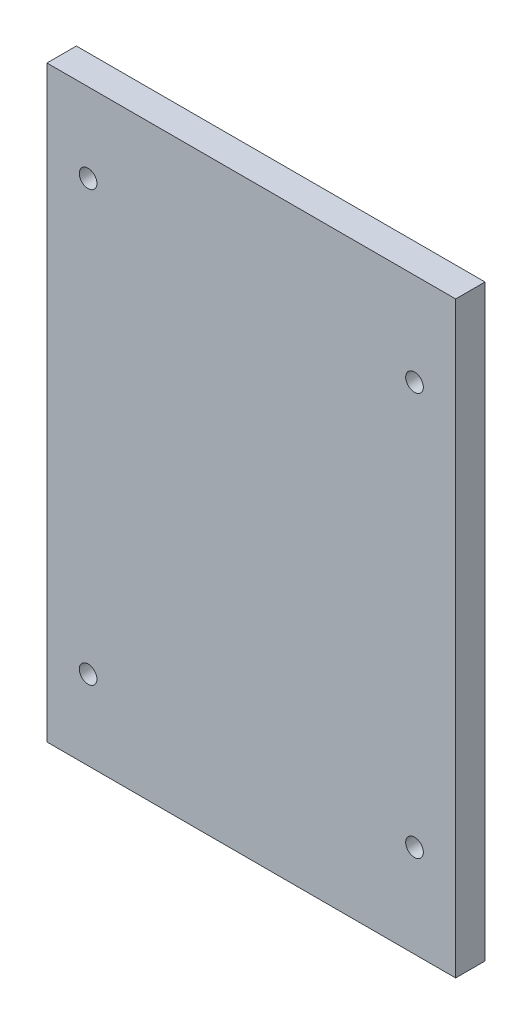
ISO-10303-21;
HEADER;
FILE_DESCRIPTION(('STEP AP214'),'2;1');
FILE_NAME('part.step','',(''),(''),'','','');
FILE_SCHEMA(('AUTOMOTIVE_DESIGN { 1 0 10303 214 1 1 1 1 }'));
ENDSEC;
DATA;
#1=APPLICATION_CONTEXT('core data for automotive mechanical design processes');
#2=APPLICATION_PROTOCOL_DEFINITION('international standard','automotive_design',2000,#1);
#3=PRODUCT_CONTEXT('',#1,'mechanical');
#4=PRODUCT('Part','Part','',(#3));
#5=PRODUCT_RELATED_PRODUCT_CATEGORY('part','',(#4));
#6=PRODUCT_DEFINITION_FORMATION('','',#4);
#7=PRODUCT_DEFINITION_CONTEXT('part definition',#1,'design');
#8=PRODUCT_DEFINITION('design','',#6,#7);
#9=PRODUCT_DEFINITION_SHAPE('','',#8);
#10=(LENGTH_UNIT() NAMED_UNIT(*) SI_UNIT(.MILLI.,.METRE.));
#11=(NAMED_UNIT(*) PLANE_ANGLE_UNIT() SI_UNIT($,.RADIAN.));
#12=(NAMED_UNIT(*) SI_UNIT($,.STERADIAN.) SOLID_ANGLE_UNIT());
#13=UNCERTAINTY_MEASURE_WITH_UNIT(LENGTH_MEASURE(1.E-05),#10,'distance_accuracy_value','');
#14=(GEOMETRIC_REPRESENTATION_CONTEXT(3) GLOBAL_UNCERTAINTY_ASSIGNED_CONTEXT((#13)) GLOBAL_UNIT_ASSIGNED_CONTEXT((#10,
#11,#12)) REPRESENTATION_CONTEXT('',''));
#15=CARTESIAN_POINT('',(0.,0.,0.));
#16=DIRECTION('',(0.,0.,1.));
#17=DIRECTION('',(1.,0.,0.));
#18=AXIS2_PLACEMENT_3D('',#15,#16,#17);
#19=CARTESIAN_POINT('',(-67.,-5.,76.0000000000007));
#20=DIRECTION('',(0.,-1.,0.));
#21=DIRECTION('',(1.,0.,0.));
#22=AXIS2_PLACEMENT_3D('',#19,#20,#21);
#23=PLANE('',#22);
#24=DIRECTION('',(1.,0.,0.));
#25=VECTOR('',#24,1.);
#26=CARTESIAN_POINT('',(-67.,-5.,81.0000000000007));
#27=LINE('',#26,#25);
#28=CARTESIAN_POINT('',(-67.,-5.,81.0000000000007));
#29=VERTEX_POINT('',#28);
#30=CARTESIAN_POINT('',(2.50000000000003,-4.99999999999999,81.0000000000007));
#31=VERTEX_POINT('',#30);
#32=EDGE_CURVE('E100',#29,#31,#27,.T.);
#33=ORIENTED_EDGE('',*,*,#32,.F.);
#34=DIRECTION('',(0.,0.,1.));
#35=VECTOR('',#34,1.);
#36=CARTESIAN_POINT('',(-67.,-5.,76.0000000000007));
#37=LINE('',#36,#35);
#38=CARTESIAN_POINT('',(-67.,-5.,76.0000000000007));
#39=VERTEX_POINT('',#38);
#40=EDGE_CURVE('E11',#39,#29,#37,.T.);
#41=ORIENTED_EDGE('',*,*,#40,.F.);
#42=DIRECTION('',(1.,0.,0.));
#43=VECTOR('',#42,1.);
#44=CARTESIAN_POINT('',(-67.,-5.,76.0000000000007));
#45=LINE('',#44,#43);
#46=CARTESIAN_POINT('',(2.50000000000003,-4.99999999999999,76.0000000000007));
#47=VERTEX_POINT('',#46);
#48=EDGE_CURVE('E93',#39,#47,#45,.T.);
#49=ORIENTED_EDGE('',*,*,#48,.T.);
#50=DIRECTION('',(0.,0.,1.));
#51=VECTOR('',#50,1.);
#52=CARTESIAN_POINT('',(2.50000000000003,-4.99999999999999,76.0000000000007));
#53=LINE('',#52,#51);
#54=EDGE_CURVE('E38',#47,#31,#53,.T.);
#55=ORIENTED_EDGE('',*,*,#54,.T.);
#56=EDGE_LOOP('',(#33,#41,#49,#55));
#57=FACE_BOUND('',#56,.T.);
#58=ADVANCED_FACE('F35',(#57),#23,.T.);
#59=CARTESIAN_POINT('',(-67.,-5.,76.0000000000007));
#60=DIRECTION('',(-1.,0.,0.));
#61=DIRECTION('',(0.,0.,1.));
#62=AXIS2_PLACEMENT_3D('',#59,#60,#61);
#63=PLANE('',#62);
#64=DIRECTION('',(0.,-1.,0.));
#65=VECTOR('',#64,1.);
#66=CARTESIAN_POINT('',(-67.,-5.,81.0000000000007));
#67=LINE('',#66,#65);
#68=CARTESIAN_POINT('',(-67.,95.,81.0000000000007));
#69=VERTEX_POINT('',#68);
#70=EDGE_CURVE('E95',#69,#29,#67,.T.);
#71=ORIENTED_EDGE('',*,*,#70,.F.);
#72=DIRECTION('',(0.,0.,1.));
#73=VECTOR('',#72,1.);
#74=CARTESIAN_POINT('',(-67.,95.,76.0000000000007));
#75=LINE('',#74,#73);
#76=CARTESIAN_POINT('',(-67.,95.,76.0000000000007));
#77=VERTEX_POINT('',#76);
#78=EDGE_CURVE('E44',#77,#69,#75,.T.);
#79=ORIENTED_EDGE('',*,*,#78,.F.);
#80=DIRECTION('',(0.,-1.,0.));
#81=VECTOR('',#80,1.);
#82=CARTESIAN_POINT('',(-67.,-5.,76.0000000000007));
#83=LINE('',#82,#81);
#84=EDGE_CURVE('E90',#77,#39,#83,.T.);
#85=ORIENTED_EDGE('',*,*,#84,.T.);
#86=ORIENTED_EDGE('',*,*,#40,.T.);
#87=EDGE_LOOP('',(#71,#79,#85,#86));
#88=FACE_BOUND('',#87,.T.);
#89=ADVANCED_FACE('F111',(#88),#63,.T.);
#90=CARTESIAN_POINT('',(2.50000000000002,95.,76.0000000000007));
#91=DIRECTION('',(0.,1.,0.));
#92=DIRECTION('',(-1.,0.,0.));
#93=AXIS2_PLACEMENT_3D('',#90,#91,#92);
#94=PLANE('',#93);
#95=DIRECTION('',(-1.,0.,0.));
#96=VECTOR('',#95,1.);
#97=CARTESIAN_POINT('',(2.50000000000002,95.,81.0000000000007));
#98=LINE('',#97,#96);
#99=CARTESIAN_POINT('',(2.50000000000002,95.,81.0000000000007));
#100=VERTEX_POINT('',#99);
#101=EDGE_CURVE('E85',#100,#69,#98,.T.);
#102=ORIENTED_EDGE('',*,*,#101,.F.);
#103=DIRECTION('',(0.,0.,1.));
#104=VECTOR('',#103,1.);
#105=CARTESIAN_POINT('',(2.50000000000002,95.,76.0000000000007));
#106=LINE('',#105,#104);
#107=CARTESIAN_POINT('',(2.50000000000002,95.,76.0000000000007));
#108=VERTEX_POINT('',#107);
#109=EDGE_CURVE('E80',#108,#100,#106,.T.);
#110=ORIENTED_EDGE('',*,*,#109,.F.);
#111=DIRECTION('',(-1.,0.,0.));
#112=VECTOR('',#111,1.);
#113=CARTESIAN_POINT('',(2.50000000000002,95.,76.0000000000007));
#114=LINE('',#113,#112);
#115=EDGE_CURVE('E83',#108,#77,#114,.T.);
#116=ORIENTED_EDGE('',*,*,#115,.T.);
#117=ORIENTED_EDGE('',*,*,#78,.T.);
#118=EDGE_LOOP('',(#102,#110,#116,#117));
#119=FACE_BOUND('',#118,.T.);
#120=ADVANCED_FACE('F82',(#119),#94,.T.);
#121=CARTESIAN_POINT('',(2.50000000000003,-4.99999999999999,76.0000000000007));
#122=DIRECTION('',(1.,0.,0.));
#123=DIRECTION('',(0.,1.,0.));
#124=AXIS2_PLACEMENT_3D('',#121,#122,#123);
#125=PLANE('',#124);
#126=DIRECTION('',(0.,1.,0.));
#127=VECTOR('',#126,1.);
#128=CARTESIAN_POINT('',(2.50000000000003,-4.99999999999999,81.0000000000007));
#129=LINE('',#128,#127);
#130=EDGE_CURVE('E103',#31,#100,#129,.T.);
#131=ORIENTED_EDGE('',*,*,#130,.F.);
#132=ORIENTED_EDGE('',*,*,#54,.F.);
#133=DIRECTION('',(0.,1.,0.));
#134=VECTOR('',#133,1.);
#135=CARTESIAN_POINT('',(2.50000000000003,-4.99999999999999,76.0000000000007));
#136=LINE('',#135,#134);
#137=EDGE_CURVE('E89',#47,#108,#136,.T.);
#138=ORIENTED_EDGE('',*,*,#137,.T.);
#139=ORIENTED_EDGE('',*,*,#109,.T.);
#140=EDGE_LOOP('',(#131,#132,#138,#139));
#141=FACE_BOUND('',#140,.T.);
#142=ADVANCED_FACE('F92',(#141),#125,.T.);
#143=CARTESIAN_POINT('',(0.,0.,76.0000000000007));
#144=DIRECTION('',(0.,0.,1.));
#145=DIRECTION('',(1.,0.,0.));
#146=AXIS2_PLACEMENT_3D('',#143,#144,#145);
#147=PLANE('',#146);
#148=CARTESIAN_POINT('',(-4.49999999999956,10.75,76.0000000000007));
#149=DIRECTION('',(0.,0.,1.));
#150=DIRECTION('',(1.,0.,0.));
#151=AXIS2_PLACEMENT_3D('',#148,#149,#150);
#152=CIRCLE('',#151,1.49999999999959);
#153=CARTESIAN_POINT('',(-2.99999999999996,10.75,76.0000000000007));
#154=VERTEX_POINT('',#153);
#155=EDGE_CURVE('E152',#154,#154,#152,.T.);
#156=ORIENTED_EDGE('',*,*,#155,.T.);
#157=EDGE_LOOP('',(#156));
#158=FACE_BOUND('',#157,.T.);
#159=CARTESIAN_POINT('',(-4.49999999999956,79.25,76.0000000000007));
#160=DIRECTION('',(0.,0.,1.));
#161=DIRECTION('',(1.,0.,0.));
#162=AXIS2_PLACEMENT_3D('',#159,#160,#161);
#163=CIRCLE('',#162,1.49999999999961);
#164=CARTESIAN_POINT('',(-2.99999999999995,79.25,76.0000000000007));
#165=VERTEX_POINT('',#164);
#166=EDGE_CURVE('E160',#165,#165,#163,.T.);
#167=ORIENTED_EDGE('',*,*,#166,.T.);
#168=EDGE_LOOP('',(#167));
#169=FACE_BOUND('',#168,.T.);
#170=CARTESIAN_POINT('',(-59.9999999999996,81.5,76.0000000000007));
#171=DIRECTION('',(0.,0.,1.));
#172=DIRECTION('',(1.,0.,0.));
#173=AXIS2_PLACEMENT_3D('',#170,#171,#172);
#174=CIRCLE('',#173,1.4999999999996);
#175=CARTESIAN_POINT('',(-58.5,81.5,76.0000000000007));
#176=VERTEX_POINT('',#175);
#177=EDGE_CURVE('E166',#176,#176,#174,.T.);
#178=ORIENTED_EDGE('',*,*,#177,.T.);
#179=EDGE_LOOP('',(#178));
#180=FACE_BOUND('',#179,.T.);
#181=CARTESIAN_POINT('',(-59.9999999999995,8.50000000000006,76.0000000000007));
#182=DIRECTION('',(0.,0.,1.));
#183=DIRECTION('',(1.,0.,0.));
#184=AXIS2_PLACEMENT_3D('',#181,#182,#183);
#185=CIRCLE('',#184,1.49999999999958);
#186=CARTESIAN_POINT('',(-58.5,8.50000000000006,76.0000000000007));
#187=VERTEX_POINT('',#186);
#188=EDGE_CURVE('E104',#187,#187,#185,.T.);
#189=ORIENTED_EDGE('',*,*,#188,.T.);
#190=EDGE_LOOP('',(#189));
#191=FACE_BOUND('',#190,.T.);
#192=ORIENTED_EDGE('',*,*,#48,.F.);
#193=ORIENTED_EDGE('',*,*,#84,.F.);
#194=ORIENTED_EDGE('',*,*,#115,.F.);
#195=ORIENTED_EDGE('',*,*,#137,.F.);
#196=EDGE_LOOP('',(#192,#193,#194,#195));
#197=FACE_BOUND('',#196,.T.);
#198=ADVANCED_FACE('F88',(#158,#169,#180,#191,#197),#147,.F.);
#199=CARTESIAN_POINT('',(0.,0.,81.0000000000007));
#200=DIRECTION('',(0.,0.,1.));
#201=DIRECTION('',(1.,0.,0.));
#202=AXIS2_PLACEMENT_3D('',#199,#200,#201);
#203=PLANE('',#202);
#204=CARTESIAN_POINT('',(-4.49999999999956,10.75,81.0000000000007));
#205=DIRECTION('',(0.,0.,1.));
#206=DIRECTION('',(1.,0.,0.));
#207=AXIS2_PLACEMENT_3D('',#204,#205,#206);
#208=CIRCLE('',#207,1.49999999999959);
#209=CARTESIAN_POINT('',(-2.99999999999996,10.75,81.0000000000007));
#210=VERTEX_POINT('',#209);
#211=EDGE_CURVE('E155',#210,#210,#208,.T.);
#212=ORIENTED_EDGE('',*,*,#211,.F.);
#213=EDGE_LOOP('',(#212));
#214=FACE_BOUND('',#213,.T.);
#215=CARTESIAN_POINT('',(-4.49999999999956,79.25,81.0000000000007));
#216=DIRECTION('',(0.,0.,1.));
#217=DIRECTION('',(1.,0.,0.));
#218=AXIS2_PLACEMENT_3D('',#215,#216,#217);
#219=CIRCLE('',#218,1.49999999999961);
#220=CARTESIAN_POINT('',(-2.99999999999995,79.25,81.0000000000007));
#221=VERTEX_POINT('',#220);
#222=EDGE_CURVE('E157',#221,#221,#219,.T.);
#223=ORIENTED_EDGE('',*,*,#222,.F.);
#224=EDGE_LOOP('',(#223));
#225=FACE_BOUND('',#224,.T.);
#226=CARTESIAN_POINT('',(-59.9999999999996,81.5,81.0000000000007));
#227=DIRECTION('',(0.,0.,1.));
#228=DIRECTION('',(1.,0.,0.));
#229=AXIS2_PLACEMENT_3D('',#226,#227,#228);
#230=CIRCLE('',#229,1.4999999999996);
#231=CARTESIAN_POINT('',(-58.5,81.5,81.0000000000007));
#232=VERTEX_POINT('',#231);
#233=EDGE_CURVE('E163',#232,#232,#230,.T.);
#234=ORIENTED_EDGE('',*,*,#233,.F.);
#235=EDGE_LOOP('',(#234));
#236=FACE_BOUND('',#235,.T.);
#237=CARTESIAN_POINT('',(-59.9999999999995,8.50000000000006,81.0000000000007));
#238=DIRECTION('',(0.,0.,1.));
#239=DIRECTION('',(1.,0.,0.));
#240=AXIS2_PLACEMENT_3D('',#237,#238,#239);
#241=CIRCLE('',#240,1.49999999999958);
#242=CARTESIAN_POINT('',(-58.5,8.50000000000006,81.0000000000007));
#243=VERTEX_POINT('',#242);
#244=EDGE_CURVE('E169',#243,#243,#241,.T.);
#245=ORIENTED_EDGE('',*,*,#244,.F.);
#246=EDGE_LOOP('',(#245));
#247=FACE_BOUND('',#246,.T.);
#248=ORIENTED_EDGE('',*,*,#32,.T.);
#249=ORIENTED_EDGE('',*,*,#130,.T.);
#250=ORIENTED_EDGE('',*,*,#101,.T.);
#251=ORIENTED_EDGE('',*,*,#70,.T.);
#252=EDGE_LOOP('',(#248,#249,#250,#251));
#253=FACE_BOUND('',#252,.T.);
#254=ADVANCED_FACE('F110',(#214,#225,#236,#247,#253),#203,.T.);
#255=CARTESIAN_POINT('',(-59.9999999999995,8.50000000000006,76.0000000000007));
#256=DIRECTION('',(0.,0.,1.));
#257=DIRECTION('',(1.,0.,0.));
#258=AXIS2_PLACEMENT_3D('',#255,#256,#257);
#259=CYLINDRICAL_SURFACE('',#258,1.49999999999958);
#260=ORIENTED_EDGE('',*,*,#188,.F.);
#261=EDGE_LOOP('',(#260));
#262=FACE_BOUND('',#261,.T.);
#263=ORIENTED_EDGE('',*,*,#244,.T.);
#264=EDGE_LOOP('',(#263));
#265=FACE_BOUND('',#264,.T.);
#266=ADVANCED_FACE('F129',(#262,#265),#259,.F.);
#267=CARTESIAN_POINT('',(-59.9999999999996,81.5,76.0000000000007));
#268=DIRECTION('',(0.,0.,1.));
#269=DIRECTION('',(1.,0.,0.));
#270=AXIS2_PLACEMENT_3D('',#267,#268,#269);
#271=CYLINDRICAL_SURFACE('',#270,1.4999999999996);
#272=ORIENTED_EDGE('',*,*,#177,.F.);
#273=EDGE_LOOP('',(#272));
#274=FACE_BOUND('',#273,.T.);
#275=ORIENTED_EDGE('',*,*,#233,.T.);
#276=EDGE_LOOP('',(#275));
#277=FACE_BOUND('',#276,.T.);
#278=ADVANCED_FACE('F136',(#274,#277),#271,.F.);
#279=CARTESIAN_POINT('',(-4.49999999999956,79.25,76.0000000000007));
#280=DIRECTION('',(0.,0.,1.));
#281=DIRECTION('',(1.,0.,0.));
#282=AXIS2_PLACEMENT_3D('',#279,#280,#281);
#283=CYLINDRICAL_SURFACE('',#282,1.49999999999961);
#284=ORIENTED_EDGE('',*,*,#166,.F.);
#285=EDGE_LOOP('',(#284));
#286=FACE_BOUND('',#285,.T.);
#287=ORIENTED_EDGE('',*,*,#222,.T.);
#288=EDGE_LOOP('',(#287));
#289=FACE_BOUND('',#288,.T.);
#290=ADVANCED_FACE('F140',(#286,#289),#283,.F.);
#291=CARTESIAN_POINT('',(-4.49999999999956,10.75,76.0000000000007));
#292=DIRECTION('',(0.,0.,1.));
#293=DIRECTION('',(1.,0.,0.));
#294=AXIS2_PLACEMENT_3D('',#291,#292,#293);
#295=CYLINDRICAL_SURFACE('',#294,1.49999999999959);
#296=ORIENTED_EDGE('',*,*,#155,.F.);
#297=EDGE_LOOP('',(#296));
#298=FACE_BOUND('',#297,.T.);
#299=ORIENTED_EDGE('',*,*,#211,.T.);
#300=EDGE_LOOP('',(#299));
#301=FACE_BOUND('',#300,.T.);
#302=ADVANCED_FACE('F144',(#298,#301),#295,.F.);
#303=CLOSED_SHELL('',(#58,#89,#120,#142,#198,#254,#266,#278,#290,#302));
#304=MANIFOLD_SOLID_BREP('B2',#303);
#305=ADVANCED_BREP_SHAPE_REPRESENTATION('',(#18,#304),#14);
#306=SHAPE_DEFINITION_REPRESENTATION(#9,#305);
ENDSEC;
END-ISO-10303-21;
